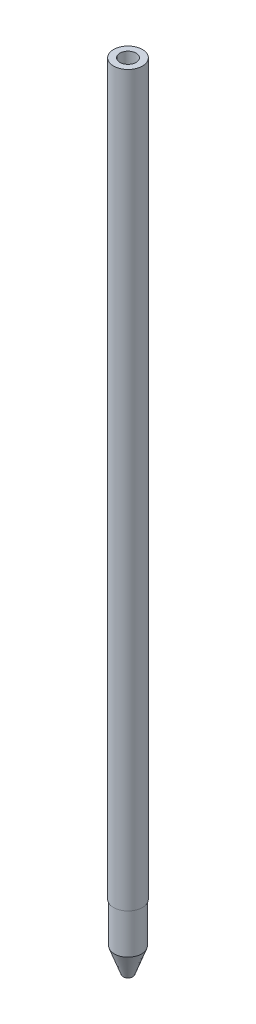
ISO-10303-21;
HEADER;
FILE_DESCRIPTION(('STEP AP214'),'2;1');
FILE_NAME('part.step','',(''),(''),'','','');
FILE_SCHEMA(('AUTOMOTIVE_DESIGN { 1 0 10303 214 1 1 1 1 }'));
ENDSEC;
DATA;
#1=APPLICATION_CONTEXT('core data for automotive mechanical design processes');
#2=APPLICATION_PROTOCOL_DEFINITION('international standard','automotive_design',2000,#1);
#3=PRODUCT_CONTEXT('',#1,'mechanical');
#4=PRODUCT('Part','Part','',(#3));
#5=PRODUCT_RELATED_PRODUCT_CATEGORY('part','',(#4));
#6=PRODUCT_DEFINITION_FORMATION('','',#4);
#7=PRODUCT_DEFINITION_CONTEXT('part definition',#1,'design');
#8=PRODUCT_DEFINITION('design','',#6,#7);
#9=PRODUCT_DEFINITION_SHAPE('','',#8);
#10=(LENGTH_UNIT() NAMED_UNIT(*) SI_UNIT(.MILLI.,.METRE.));
#11=(NAMED_UNIT(*) PLANE_ANGLE_UNIT() SI_UNIT($,.RADIAN.));
#12=(NAMED_UNIT(*) SI_UNIT($,.STERADIAN.) SOLID_ANGLE_UNIT());
#13=UNCERTAINTY_MEASURE_WITH_UNIT(LENGTH_MEASURE(1.E-05),#10,'distance_accuracy_value','');
#14=(GEOMETRIC_REPRESENTATION_CONTEXT(3) GLOBAL_UNCERTAINTY_ASSIGNED_CONTEXT((#13)) GLOBAL_UNIT_ASSIGNED_CONTEXT((#10,
#11,#12)) REPRESENTATION_CONTEXT('',''));
#15=CARTESIAN_POINT('',(0.,0.,0.));
#16=DIRECTION('',(0.,0.,1.));
#17=DIRECTION('',(1.,0.,0.));
#18=AXIS2_PLACEMENT_3D('',#15,#16,#17);
#19=CARTESIAN_POINT('',(0.,89.9922,0.));
#20=DIRECTION('',(0.,-1.,0.));
#21=DIRECTION('',(0.,0.,-1.));
#22=AXIS2_PLACEMENT_3D('',#19,#20,#21);
#23=CYLINDRICAL_SURFACE('',#22,1.778);
#24=CARTESIAN_POINT('',(0.,89.9922,0.));
#25=DIRECTION('',(0.,1.,0.));
#26=DIRECTION('',(0.,0.,1.));
#27=AXIS2_PLACEMENT_3D('',#24,#25,#26);
#28=CIRCLE('',#27,1.778);
#29=CARTESIAN_POINT('',(0.,89.9922,1.778));
#30=VERTEX_POINT('',#29);
#31=EDGE_CURVE('E62',#30,#30,#28,.T.);
#32=ORIENTED_EDGE('',*,*,#31,.F.);
#33=EDGE_LOOP('',(#32));
#34=FACE_BOUND('',#33,.T.);
#35=CARTESIAN_POINT('',(0.,0.,0.));
#36=DIRECTION('',(0.,1.,0.));
#37=DIRECTION('',(0.,0.,1.));
#38=AXIS2_PLACEMENT_3D('',#35,#36,#37);
#39=CIRCLE('',#38,1.778);
#40=CARTESIAN_POINT('',(0.,0.,1.778));
#41=VERTEX_POINT('',#40);
#42=EDGE_CURVE('E66',#41,#41,#39,.T.);
#43=ORIENTED_EDGE('',*,*,#42,.T.);
#44=EDGE_LOOP('',(#43));
#45=FACE_BOUND('',#44,.T.);
#46=ADVANCED_FACE('F42',(#34,#45),#23,.T.);
#47=CARTESIAN_POINT('',(0.,89.9922,0.));
#48=DIRECTION('',(0.,1.,0.));
#49=DIRECTION('',(0.,0.,1.));
#50=AXIS2_PLACEMENT_3D('',#47,#48,#49);
#51=PLANE('',#50);
#52=CARTESIAN_POINT('',(0.,89.9922,0.));
#53=DIRECTION('',(0.,1.,0.));
#54=DIRECTION('',(0.,0.,1.));
#55=AXIS2_PLACEMENT_3D('',#52,#53,#54);
#56=CIRCLE('',#55,0.99949);
#57=CARTESIAN_POINT('',(0.,89.9922,0.99949));
#58=VERTEX_POINT('',#57);
#59=EDGE_CURVE('E56',#58,#58,#56,.T.);
#60=ORIENTED_EDGE('',*,*,#59,.F.);
#61=EDGE_LOOP('',(#60));
#62=FACE_BOUND('',#61,.T.);
#63=ORIENTED_EDGE('',*,*,#31,.T.);
#64=EDGE_LOOP('',(#63));
#65=FACE_BOUND('',#64,.T.);
#66=ADVANCED_FACE('F77',(#62,#65),#51,.T.);
#67=CARTESIAN_POINT('',(0.,0.,0.));
#68=DIRECTION('',(0.,1.,0.));
#69=DIRECTION('',(0.,0.,1.));
#70=AXIS2_PLACEMENT_3D('',#67,#68,#69);
#71=PLANE('',#70);
#72=CARTESIAN_POINT('',(0.,0.,0.));
#73=DIRECTION('',(0.,1.,0.));
#74=DIRECTION('',(0.,0.,1.));
#75=AXIS2_PLACEMENT_3D('',#72,#73,#74);
#76=CIRCLE('',#75,1.7526);
#77=CARTESIAN_POINT('',(0.,0.,1.7526));
#78=VERTEX_POINT('',#77);
#79=EDGE_CURVE('E54',#78,#78,#76,.F.);
#80=ORIENTED_EDGE('',*,*,#79,.F.);
#81=EDGE_LOOP('',(#80));
#82=FACE_BOUND('',#81,.T.);
#83=ORIENTED_EDGE('',*,*,#42,.F.);
#84=EDGE_LOOP('',(#83));
#85=FACE_BOUND('',#84,.T.);
#86=ADVANCED_FACE('F74',(#82,#85),#71,.F.);
#87=CARTESIAN_POINT('',(0.,2.99720000000001,0.));
#88=DIRECTION('',(0.,1.,0.));
#89=DIRECTION('',(0.,0.,1.));
#90=AXIS2_PLACEMENT_3D('',#87,#88,#89);
#91=CYLINDRICAL_SURFACE('',#90,0.99949);
#92=CARTESIAN_POINT('',(0.,2.99720000000001,0.));
#93=DIRECTION('',(0.,1.,0.));
#94=DIRECTION('',(0.,0.,1.));
#95=AXIS2_PLACEMENT_3D('',#92,#93,#94);
#96=CIRCLE('',#95,0.99949);
#97=CARTESIAN_POINT('',(0.,2.99720000000001,0.99949));
#98=VERTEX_POINT('',#97);
#99=EDGE_CURVE('E11',#98,#98,#96,.T.);
#100=ORIENTED_EDGE('',*,*,#99,.F.);
#101=EDGE_LOOP('',(#100));
#102=FACE_BOUND('',#101,.T.);
#103=ORIENTED_EDGE('',*,*,#59,.T.);
#104=EDGE_LOOP('',(#103));
#105=FACE_BOUND('',#104,.T.);
#106=ADVANCED_FACE('F76',(#102,#105),#91,.F.);
#107=CARTESIAN_POINT('',(0.,-4.95710137883017,0.));
#108=DIRECTION('',(0.,1.,0.));
#109=DIRECTION('',(0.,0.,1.));
#110=AXIS2_PLACEMENT_3D('',#107,#108,#109);
#111=CYLINDRICAL_SURFACE('',#110,1.7526);
#112=ORIENTED_EDGE('',*,*,#79,.T.);
#113=EDGE_LOOP('',(#112));
#114=FACE_BOUND('',#113,.T.);
#115=CARTESIAN_POINT('',(0.,2.9972,0.));
#116=DIRECTION('',(0.,1.,0.));
#117=DIRECTION('',(0.,0.,1.));
#118=AXIS2_PLACEMENT_3D('',#115,#116,#117);
#119=CIRCLE('',#118,1.7526);
#120=CARTESIAN_POINT('',(0.,2.9972,1.7526));
#121=VERTEX_POINT('',#120);
#122=EDGE_CURVE('E46',#121,#121,#119,.T.);
#123=ORIENTED_EDGE('',*,*,#122,.T.);
#124=EDGE_LOOP('',(#123));
#125=FACE_BOUND('',#124,.T.);
#126=ADVANCED_FACE('F84',(#114,#125),#111,.F.);
#127=CARTESIAN_POINT('',(0.,2.9972,0.));
#128=DIRECTION('',(0.,1.,0.));
#129=DIRECTION('',(0.,0.,1.));
#130=AXIS2_PLACEMENT_3D('',#127,#128,#129);
#131=PLANE('',#130);
#132=ORIENTED_EDGE('',*,*,#99,.T.);
#133=EDGE_LOOP('',(#132));
#134=FACE_BOUND('',#133,.T.);
#135=ORIENTED_EDGE('',*,*,#122,.F.);
#136=EDGE_LOOP('',(#135));
#137=FACE_BOUND('',#136,.T.);
#138=ADVANCED_FACE('F44',(#134,#137),#131,.F.);
#139=CLOSED_SHELL('',(#46,#66,#86,#106,#126,#138));
#140=MANIFOLD_SOLID_BREP('B2',#139);
#141=CARTESIAN_POINT('',(0.,-5.0038,0.));
#142=DIRECTION('',(0.,1.,0.));
#143=DIRECTION('',(0.,0.,1.));
#144=AXIS2_PLACEMENT_3D('',#141,#142,#143);
#145=CYLINDRICAL_SURFACE('',#144,1.6891);
#146=CARTESIAN_POINT('',(0.,-5.0038,0.));
#147=DIRECTION('',(0.,1.,0.));
#148=DIRECTION('',(0.,0.,1.));
#149=AXIS2_PLACEMENT_3D('',#146,#147,#148);
#150=CIRCLE('',#149,1.6891);
#151=CARTESIAN_POINT('',(0.,-5.0038,1.6891));
#152=VERTEX_POINT('',#151);
#153=EDGE_CURVE('E145',#152,#152,#150,.T.);
#154=ORIENTED_EDGE('',*,*,#153,.T.);
#155=EDGE_LOOP('',(#154));
#156=FACE_BOUND('',#155,.T.);
#157=CARTESIAN_POINT('',(0.,0.,0.));
#158=DIRECTION('',(0.,1.,0.));
#159=DIRECTION('',(0.,0.,1.));
#160=AXIS2_PLACEMENT_3D('',#157,#158,#159);
#161=CIRCLE('',#160,1.6891);
#162=CARTESIAN_POINT('',(0.,0.,1.6891));
#163=VERTEX_POINT('',#162);
#164=EDGE_CURVE('E41',#163,#163,#161,.F.);
#165=ORIENTED_EDGE('',*,*,#164,.T.);
#166=EDGE_LOOP('',(#165));
#167=FACE_BOUND('',#166,.T.);
#168=ADVANCED_FACE('F135',(#156,#167),#145,.T.);
#169=CARTESIAN_POINT('',(0.,0.,0.));
#170=DIRECTION('',(0.,1.,0.));
#171=DIRECTION('',(0.,0.,1.));
#172=AXIS2_PLACEMENT_3D('',#169,#170,#171);
#173=PLANE('',#172);
#174=ORIENTED_EDGE('',*,*,#164,.F.);
#175=EDGE_LOOP('',(#174));
#176=FACE_BOUND('',#175,.T.);
#177=ADVANCED_FACE('F160',(#176),#173,.T.);
#178=CARTESIAN_POINT('',(-0.598208413857336,-8.001,0.));
#179=DIRECTION('',(0.,-1.,0.));
#180=DIRECTION('',(0.,0.,-1.));
#181=AXIS2_PLACEMENT_3D('',#178,#179,#180);
#182=PLANE('',#181);
#183=CARTESIAN_POINT('',(0.,-8.001,0.));
#184=DIRECTION('',(0.,1.,0.));
#185=DIRECTION('',(0.,0.,1.));
#186=AXIS2_PLACEMENT_3D('',#183,#184,#185);
#187=CIRCLE('',#186,0.598208413857336);
#188=CARTESIAN_POINT('',(0.,-8.001,0.598208413857336));
#189=VERTEX_POINT('',#188);
#190=EDGE_CURVE('E141',#189,#189,#187,.T.);
#191=ORIENTED_EDGE('',*,*,#190,.F.);
#192=EDGE_LOOP('',(#191));
#193=FACE_BOUND('',#192,.T.);
#194=ADVANCED_FACE('F155',(#193),#182,.T.);
#195=CARTESIAN_POINT('',(0.,-5.0038,0.));
#196=DIRECTION('',(0.,1.,0.));
#197=DIRECTION('',(0.,0.,1.));
#198=AXIS2_PLACEMENT_3D('',#195,#196,#197);
#199=CONICAL_SURFACE('',#198,1.6891,0.349065850398867);
#200=ORIENTED_EDGE('',*,*,#190,.T.);
#201=EDGE_LOOP('',(#200));
#202=FACE_BOUND('',#201,.T.);
#203=ORIENTED_EDGE('',*,*,#153,.F.);
#204=EDGE_LOOP('',(#203));
#205=FACE_BOUND('',#204,.T.);
#206=ADVANCED_FACE('F153',(#202,#205),#199,.T.);
#207=CLOSED_SHELL('',(#168,#177,#194,#206));
#208=MANIFOLD_SOLID_BREP('B6',#207);
#209=ADVANCED_BREP_SHAPE_REPRESENTATION('',(#18,#140,#208),#14);
#210=SHAPE_DEFINITION_REPRESENTATION(#9,#209);
ENDSEC;
END-ISO-10303-21;
